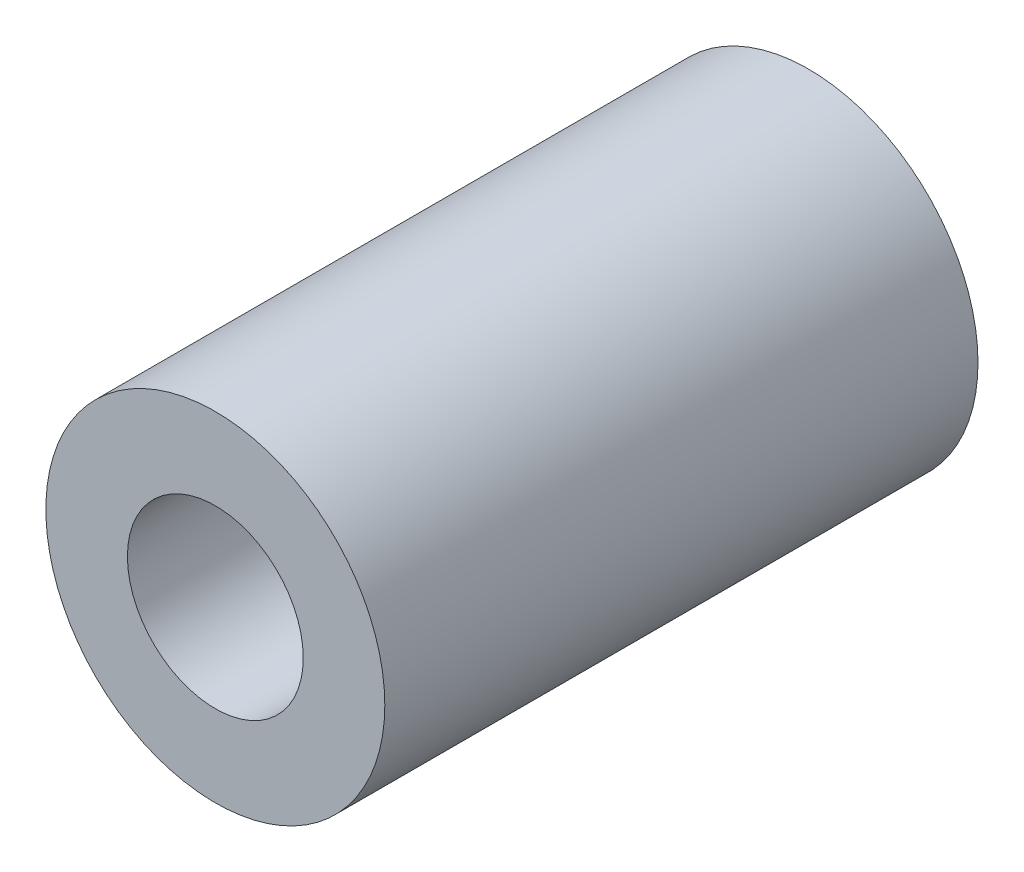
ISO-10303-21;
HEADER;
FILE_DESCRIPTION(('STEP AP214'),'2;1');
FILE_NAME('part.step','',(''),(''),'','','');
FILE_SCHEMA(('AUTOMOTIVE_DESIGN { 1 0 10303 214 1 1 1 1 }'));
ENDSEC;
DATA;
#1=APPLICATION_CONTEXT('core data for automotive mechanical design processes');
#2=APPLICATION_PROTOCOL_DEFINITION('international standard','automotive_design',2000,#1);
#3=PRODUCT_CONTEXT('',#1,'mechanical');
#4=PRODUCT('Part','Part','',(#3));
#5=PRODUCT_RELATED_PRODUCT_CATEGORY('part','',(#4));
#6=PRODUCT_DEFINITION_FORMATION('','',#4);
#7=PRODUCT_DEFINITION_CONTEXT('part definition',#1,'design');
#8=PRODUCT_DEFINITION('design','',#6,#7);
#9=PRODUCT_DEFINITION_SHAPE('','',#8);
#10=(LENGTH_UNIT() NAMED_UNIT(*) SI_UNIT(.MILLI.,.METRE.));
#11=(NAMED_UNIT(*) PLANE_ANGLE_UNIT() SI_UNIT($,.RADIAN.));
#12=(NAMED_UNIT(*) SI_UNIT($,.STERADIAN.) SOLID_ANGLE_UNIT());
#13=UNCERTAINTY_MEASURE_WITH_UNIT(LENGTH_MEASURE(1.E-05),#10,'distance_accuracy_value','');
#14=(GEOMETRIC_REPRESENTATION_CONTEXT(3) GLOBAL_UNCERTAINTY_ASSIGNED_CONTEXT((#13)) GLOBAL_UNIT_ASSIGNED_CONTEXT((#10,
#11,#12)) REPRESENTATION_CONTEXT('',''));
#15=CARTESIAN_POINT('',(0.,0.,0.));
#16=DIRECTION('',(0.,0.,1.));
#17=DIRECTION('',(1.,0.,0.));
#18=AXIS2_PLACEMENT_3D('',#15,#16,#17);
#19=CARTESIAN_POINT('',(0.,0.,28.));
#20=DIRECTION('',(0.,0.,1.));
#21=DIRECTION('',(1.,0.,0.));
#22=AXIS2_PLACEMENT_3D('',#19,#20,#21);
#23=PLANE('',#22);
#24=CARTESIAN_POINT('',(0.,0.,28.));
#25=DIRECTION('',(0.,0.,1.));
#26=DIRECTION('',(1.,0.,0.));
#27=AXIS2_PLACEMENT_3D('',#24,#25,#26);
#28=CIRCLE('',#27,8.);
#29=CARTESIAN_POINT('',(8.,0.,28.));
#30=VERTEX_POINT('',#29);
#31=EDGE_CURVE('E10',#30,#30,#28,.T.);
#32=ORIENTED_EDGE('',*,*,#31,.T.);
#33=EDGE_LOOP('',(#32));
#34=FACE_BOUND('',#33,.T.);
#35=CARTESIAN_POINT('',(0.,0.,28.));
#36=DIRECTION('',(0.,0.,1.));
#37=DIRECTION('',(1.,0.,0.));
#38=AXIS2_PLACEMENT_3D('',#35,#36,#37);
#39=CIRCLE('',#38,4.15);
#40=CARTESIAN_POINT('',(4.15,0.,28.));
#41=VERTEX_POINT('',#40);
#42=EDGE_CURVE('E43',#41,#41,#39,.T.);
#43=ORIENTED_EDGE('',*,*,#42,.F.);
#44=EDGE_LOOP('',(#43));
#45=FACE_BOUND('',#44,.T.);
#46=ADVANCED_FACE('F32',(#34,#45),#23,.T.);
#47=CARTESIAN_POINT('',(0.,0.,0.));
#48=DIRECTION('',(0.,0.,1.));
#49=DIRECTION('',(1.,0.,0.));
#50=AXIS2_PLACEMENT_3D('',#47,#48,#49);
#51=PLANE('',#50);
#52=CARTESIAN_POINT('',(0.,0.,0.));
#53=DIRECTION('',(0.,0.,1.));
#54=DIRECTION('',(1.,0.,0.));
#55=AXIS2_PLACEMENT_3D('',#52,#53,#54);
#56=CIRCLE('',#55,8.);
#57=CARTESIAN_POINT('',(8.,0.,0.));
#58=VERTEX_POINT('',#57);
#59=EDGE_CURVE('E36',#58,#58,#56,.T.);
#60=ORIENTED_EDGE('',*,*,#59,.F.);
#61=EDGE_LOOP('',(#60));
#62=FACE_BOUND('',#61,.T.);
#63=CARTESIAN_POINT('',(0.,0.,0.));
#64=DIRECTION('',(0.,0.,1.));
#65=DIRECTION('',(1.,0.,0.));
#66=AXIS2_PLACEMENT_3D('',#63,#64,#65);
#67=CIRCLE('',#66,4.15);
#68=CARTESIAN_POINT('',(4.15,0.,0.));
#69=VERTEX_POINT('',#68);
#70=EDGE_CURVE('E45',#69,#69,#67,.T.);
#71=ORIENTED_EDGE('',*,*,#70,.T.);
#72=EDGE_LOOP('',(#71));
#73=FACE_BOUND('',#72,.T.);
#74=ADVANCED_FACE('F55',(#62,#73),#51,.F.);
#75=CARTESIAN_POINT('',(0.,0.,28.));
#76=DIRECTION('',(0.,0.,-1.));
#77=DIRECTION('',(-1.,0.,0.));
#78=AXIS2_PLACEMENT_3D('',#75,#76,#77);
#79=CYLINDRICAL_SURFACE('',#78,8.);
#80=ORIENTED_EDGE('',*,*,#31,.F.);
#81=EDGE_LOOP('',(#80));
#82=FACE_BOUND('',#81,.T.);
#83=ORIENTED_EDGE('',*,*,#59,.T.);
#84=EDGE_LOOP('',(#83));
#85=FACE_BOUND('',#84,.T.);
#86=ADVANCED_FACE('F34',(#82,#85),#79,.T.);
#87=CARTESIAN_POINT('',(0.,0.,28.));
#88=DIRECTION('',(0.,0.,-1.));
#89=DIRECTION('',(-1.,0.,0.));
#90=AXIS2_PLACEMENT_3D('',#87,#88,#89);
#91=CYLINDRICAL_SURFACE('',#90,4.15);
#92=ORIENTED_EDGE('',*,*,#42,.T.);
#93=EDGE_LOOP('',(#92));
#94=FACE_BOUND('',#93,.T.);
#95=ORIENTED_EDGE('',*,*,#70,.F.);
#96=EDGE_LOOP('',(#95));
#97=FACE_BOUND('',#96,.T.);
#98=ADVANCED_FACE('F51',(#94,#97),#91,.F.);
#99=CLOSED_SHELL('',(#46,#74,#86,#98));
#100=MANIFOLD_SOLID_BREP('B2',#99);
#101=ADVANCED_BREP_SHAPE_REPRESENTATION('',(#18,#100),#14);
#102=SHAPE_DEFINITION_REPRESENTATION(#9,#101);
ENDSEC;
END-ISO-10303-21;
